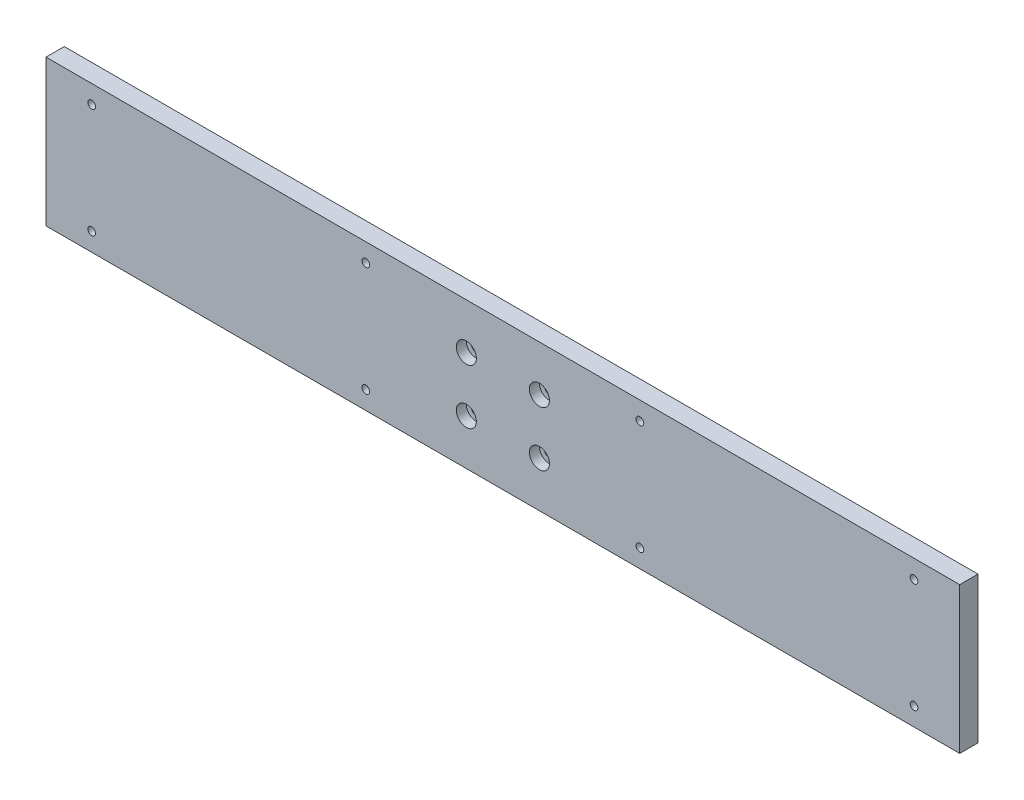
ISO-10303-21;
HEADER;
FILE_DESCRIPTION(('STEP AP214'),'2;1');
FILE_NAME('part.step','',(''),(''),'','','');
FILE_SCHEMA(('AUTOMOTIVE_DESIGN { 1 0 10303 214 1 1 1 1 }'));
ENDSEC;
DATA;
#1=APPLICATION_CONTEXT('core data for automotive mechanical design processes');
#2=APPLICATION_PROTOCOL_DEFINITION('international standard','automotive_design',2000,#1);
#3=PRODUCT_CONTEXT('',#1,'mechanical');
#4=PRODUCT('Part','Part','',(#3));
#5=PRODUCT_RELATED_PRODUCT_CATEGORY('part','',(#4));
#6=PRODUCT_DEFINITION_FORMATION('','',#4);
#7=PRODUCT_DEFINITION_CONTEXT('part definition',#1,'design');
#8=PRODUCT_DEFINITION('design','',#6,#7);
#9=PRODUCT_DEFINITION_SHAPE('','',#8);
#10=(LENGTH_UNIT() NAMED_UNIT(*) SI_UNIT(.MILLI.,.METRE.));
#11=(NAMED_UNIT(*) PLANE_ANGLE_UNIT() SI_UNIT($,.RADIAN.));
#12=(NAMED_UNIT(*) SI_UNIT($,.STERADIAN.) SOLID_ANGLE_UNIT());
#13=UNCERTAINTY_MEASURE_WITH_UNIT(LENGTH_MEASURE(1.E-05),#10,'distance_accuracy_value','');
#14=(GEOMETRIC_REPRESENTATION_CONTEXT(3) GLOBAL_UNCERTAINTY_ASSIGNED_CONTEXT((#13)) GLOBAL_UNIT_ASSIGNED_CONTEXT((#10,
#11,#12)) REPRESENTATION_CONTEXT('',''));
#15=CARTESIAN_POINT('',(0.,0.,0.));
#16=DIRECTION('',(0.,0.,1.));
#17=DIRECTION('',(1.,0.,0.));
#18=AXIS2_PLACEMENT_3D('',#15,#16,#17);
#19=CARTESIAN_POINT('',(-20.,15.,0.));
#20=DIRECTION('',(0.,0.,1.));
#21=DIRECTION('',(1.,0.,0.));
#22=AXIS2_PLACEMENT_3D('',#19,#20,#21);
#23=CYLINDRICAL_SURFACE('',#22,2.75);
#24=CARTESIAN_POINT('',(-20.,15.,0.));
#25=DIRECTION('',(0.,0.,1.));
#26=DIRECTION('',(1.,0.,0.));
#27=AXIS2_PLACEMENT_3D('',#24,#25,#26);
#28=CIRCLE('',#27,2.75);
#29=CARTESIAN_POINT('',(-17.25,15.,0.));
#30=VERTEX_POINT('',#29);
#31=EDGE_CURVE('E123',#30,#30,#28,.T.);
#32=ORIENTED_EDGE('',*,*,#31,.F.);
#33=EDGE_LOOP('',(#32));
#34=FACE_BOUND('',#33,.T.);
#35=CARTESIAN_POINT('',(-20.,15.,4.5));
#36=DIRECTION('',(0.,0.,1.));
#37=DIRECTION('',(1.,0.,0.));
#38=AXIS2_PLACEMENT_3D('',#35,#36,#37);
#39=CIRCLE('',#38,2.75);
#40=CARTESIAN_POINT('',(-17.25,15.,4.5));
#41=VERTEX_POINT('',#40);
#42=EDGE_CURVE('E147',#41,#41,#39,.F.);
#43=ORIENTED_EDGE('',*,*,#42,.F.);
#44=EDGE_LOOP('',(#43));
#45=FACE_BOUND('',#44,.T.);
#46=ADVANCED_FACE('F46',(#34,#45),#23,.F.);
#47=CARTESIAN_POINT('',(20.,15.,0.));
#48=DIRECTION('',(0.,0.,1.));
#49=DIRECTION('',(1.,0.,0.));
#50=AXIS2_PLACEMENT_3D('',#47,#48,#49);
#51=CYLINDRICAL_SURFACE('',#50,2.75);
#52=CARTESIAN_POINT('',(20.,15.,0.));
#53=DIRECTION('',(0.,0.,1.));
#54=DIRECTION('',(1.,0.,0.));
#55=AXIS2_PLACEMENT_3D('',#52,#53,#54);
#56=CIRCLE('',#55,2.75);
#57=CARTESIAN_POINT('',(22.75,15.,0.));
#58=VERTEX_POINT('',#57);
#59=EDGE_CURVE('E210',#58,#58,#56,.T.);
#60=ORIENTED_EDGE('',*,*,#59,.F.);
#61=EDGE_LOOP('',(#60));
#62=FACE_BOUND('',#61,.T.);
#63=CARTESIAN_POINT('',(20.,15.,4.5));
#64=DIRECTION('',(0.,0.,1.));
#65=DIRECTION('',(1.,0.,0.));
#66=AXIS2_PLACEMENT_3D('',#63,#64,#65);
#67=CIRCLE('',#66,2.75);
#68=CARTESIAN_POINT('',(22.75,15.,4.5));
#69=VERTEX_POINT('',#68);
#70=EDGE_CURVE('E143',#69,#69,#67,.F.);
#71=ORIENTED_EDGE('',*,*,#70,.F.);
#72=EDGE_LOOP('',(#71));
#73=FACE_BOUND('',#72,.T.);
#74=ADVANCED_FACE('F255',(#62,#73),#51,.F.);
#75=CARTESIAN_POINT('',(20.,-15.,0.));
#76=DIRECTION('',(0.,0.,1.));
#77=DIRECTION('',(1.,0.,0.));
#78=AXIS2_PLACEMENT_3D('',#75,#76,#77);
#79=CYLINDRICAL_SURFACE('',#78,2.75);
#80=CARTESIAN_POINT('',(20.,-15.,0.));
#81=DIRECTION('',(0.,0.,1.));
#82=DIRECTION('',(1.,0.,0.));
#83=AXIS2_PLACEMENT_3D('',#80,#81,#82);
#84=CIRCLE('',#83,2.75);
#85=CARTESIAN_POINT('',(22.75,-15.,0.));
#86=VERTEX_POINT('',#85);
#87=EDGE_CURVE('E214',#86,#86,#84,.T.);
#88=ORIENTED_EDGE('',*,*,#87,.F.);
#89=EDGE_LOOP('',(#88));
#90=FACE_BOUND('',#89,.T.);
#91=CARTESIAN_POINT('',(20.,-15.,4.5));
#92=DIRECTION('',(0.,0.,1.));
#93=DIRECTION('',(1.,0.,0.));
#94=AXIS2_PLACEMENT_3D('',#91,#92,#93);
#95=CIRCLE('',#94,2.75);
#96=CARTESIAN_POINT('',(22.75,-15.,4.5));
#97=VERTEX_POINT('',#96);
#98=EDGE_CURVE('E138',#97,#97,#95,.F.);
#99=ORIENTED_EDGE('',*,*,#98,.F.);
#100=EDGE_LOOP('',(#99));
#101=FACE_BOUND('',#100,.T.);
#102=ADVANCED_FACE('F285',(#90,#101),#79,.F.);
#103=CARTESIAN_POINT('',(-20.,-15.,0.));
#104=DIRECTION('',(0.,0.,1.));
#105=DIRECTION('',(1.,0.,0.));
#106=AXIS2_PLACEMENT_3D('',#103,#104,#105);
#107=CYLINDRICAL_SURFACE('',#106,2.75);
#108=CARTESIAN_POINT('',(-20.,-15.,0.));
#109=DIRECTION('',(0.,0.,1.));
#110=DIRECTION('',(1.,0.,0.));
#111=AXIS2_PLACEMENT_3D('',#108,#109,#110);
#112=CIRCLE('',#111,2.75);
#113=CARTESIAN_POINT('',(-17.25,-15.,0.));
#114=VERTEX_POINT('',#113);
#115=EDGE_CURVE('E150',#114,#114,#112,.T.);
#116=ORIENTED_EDGE('',*,*,#115,.F.);
#117=EDGE_LOOP('',(#116));
#118=FACE_BOUND('',#117,.T.);
#119=CARTESIAN_POINT('',(-20.,-15.,4.5));
#120=DIRECTION('',(0.,0.,1.));
#121=DIRECTION('',(1.,0.,0.));
#122=AXIS2_PLACEMENT_3D('',#119,#120,#121);
#123=CIRCLE('',#122,2.75);
#124=CARTESIAN_POINT('',(-17.25,-15.,4.5));
#125=VERTEX_POINT('',#124);
#126=EDGE_CURVE('E134',#125,#125,#123,.F.);
#127=ORIENTED_EDGE('',*,*,#126,.F.);
#128=EDGE_LOOP('',(#127));
#129=FACE_BOUND('',#128,.T.);
#130=ADVANCED_FACE('F289',(#118,#129),#107,.F.);
#131=CARTESIAN_POINT('',(250.,-40.,10.));
#132=DIRECTION('',(-1.,0.,0.));
#133=DIRECTION('',(0.,0.,1.));
#134=AXIS2_PLACEMENT_3D('',#131,#132,#133);
#135=PLANE('',#134);
#136=DIRECTION('',(0.,1.,0.));
#137=VECTOR('',#136,1.);
#138=CARTESIAN_POINT('',(250.,-40.,0.));
#139=LINE('',#138,#137);
#140=CARTESIAN_POINT('',(250.,-40.,0.));
#141=VERTEX_POINT('',#140);
#142=CARTESIAN_POINT('',(250.,40.,0.));
#143=VERTEX_POINT('',#142);
#144=EDGE_CURVE('E119',#141,#143,#139,.T.);
#145=ORIENTED_EDGE('',*,*,#144,.T.);
#146=DIRECTION('',(0.,0.,-1.));
#147=VECTOR('',#146,1.);
#148=CARTESIAN_POINT('',(250.,40.,10.));
#149=LINE('',#148,#147);
#150=CARTESIAN_POINT('',(250.,40.,10.));
#151=VERTEX_POINT('',#150);
#152=EDGE_CURVE('E11',#151,#143,#149,.T.);
#153=ORIENTED_EDGE('',*,*,#152,.F.);
#154=DIRECTION('',(0.,1.,0.));
#155=VECTOR('',#154,1.);
#156=CARTESIAN_POINT('',(250.,-40.,10.));
#157=LINE('',#156,#155);
#158=CARTESIAN_POINT('',(250.,-40.,10.));
#159=VERTEX_POINT('',#158);
#160=EDGE_CURVE('E101',#159,#151,#157,.T.);
#161=ORIENTED_EDGE('',*,*,#160,.F.);
#162=DIRECTION('',(0.,0.,-1.));
#163=VECTOR('',#162,1.);
#164=CARTESIAN_POINT('',(250.,-40.,10.));
#165=LINE('',#164,#163);
#166=EDGE_CURVE('E115',#159,#141,#165,.T.);
#167=ORIENTED_EDGE('',*,*,#166,.T.);
#168=EDGE_LOOP('',(#145,#153,#161,#167));
#169=FACE_BOUND('',#168,.T.);
#170=ADVANCED_FACE('F48',(#169),#135,.F.);
#171=CARTESIAN_POINT('',(-250.,40.,10.));
#172=DIRECTION('',(0.,-1.,0.));
#173=DIRECTION('',(0.,0.,-1.));
#174=AXIS2_PLACEMENT_3D('',#171,#172,#173);
#175=PLANE('',#174);
#176=DIRECTION('',(-1.,0.,0.));
#177=VECTOR('',#176,1.);
#178=CARTESIAN_POINT('',(-250.,40.,0.));
#179=LINE('',#178,#177);
#180=CARTESIAN_POINT('',(-250.,40.,0.));
#181=VERTEX_POINT('',#180);
#182=EDGE_CURVE('E106',#143,#181,#179,.T.);
#183=ORIENTED_EDGE('',*,*,#182,.T.);
#184=DIRECTION('',(0.,0.,-1.));
#185=VECTOR('',#184,1.);
#186=CARTESIAN_POINT('',(-250.,40.,10.));
#187=LINE('',#186,#185);
#188=CARTESIAN_POINT('',(-250.,40.,10.));
#189=VERTEX_POINT('',#188);
#190=EDGE_CURVE('E57',#189,#181,#187,.T.);
#191=ORIENTED_EDGE('',*,*,#190,.F.);
#192=DIRECTION('',(-1.,0.,0.));
#193=VECTOR('',#192,1.);
#194=CARTESIAN_POINT('',(-250.,40.,10.));
#195=LINE('',#194,#193);
#196=EDGE_CURVE('E96',#151,#189,#195,.T.);
#197=ORIENTED_EDGE('',*,*,#196,.F.);
#198=ORIENTED_EDGE('',*,*,#152,.T.);
#199=EDGE_LOOP('',(#183,#191,#197,#198));
#200=FACE_BOUND('',#199,.T.);
#201=ADVANCED_FACE('F105',(#200),#175,.F.);
#202=CARTESIAN_POINT('',(-250.,-40.,10.));
#203=DIRECTION('',(1.,0.,0.));
#204=DIRECTION('',(0.,0.,-1.));
#205=AXIS2_PLACEMENT_3D('',#202,#203,#204);
#206=PLANE('',#205);
#207=DIRECTION('',(0.,-1.,0.));
#208=VECTOR('',#207,1.);
#209=CARTESIAN_POINT('',(-250.,-40.,0.));
#210=LINE('',#209,#208);
#211=CARTESIAN_POINT('',(-250.,-40.,0.));
#212=VERTEX_POINT('',#211);
#213=EDGE_CURVE('E83',#181,#212,#210,.T.);
#214=ORIENTED_EDGE('',*,*,#213,.T.);
#215=DIRECTION('',(0.,0.,-1.));
#216=VECTOR('',#215,1.);
#217=CARTESIAN_POINT('',(-250.,-40.,10.));
#218=LINE('',#217,#216);
#219=CARTESIAN_POINT('',(-250.,-40.,10.));
#220=VERTEX_POINT('',#219);
#221=EDGE_CURVE('E108',#220,#212,#218,.T.);
#222=ORIENTED_EDGE('',*,*,#221,.F.);
#223=DIRECTION('',(0.,-1.,0.));
#224=VECTOR('',#223,1.);
#225=CARTESIAN_POINT('',(-250.,-40.,10.));
#226=LINE('',#225,#224);
#227=EDGE_CURVE('E99',#189,#220,#226,.T.);
#228=ORIENTED_EDGE('',*,*,#227,.F.);
#229=ORIENTED_EDGE('',*,*,#190,.T.);
#230=EDGE_LOOP('',(#214,#222,#228,#229));
#231=FACE_BOUND('',#230,.T.);
#232=ADVANCED_FACE('F110',(#231),#206,.F.);
#233=CARTESIAN_POINT('',(-250.,-40.,10.));
#234=DIRECTION('',(0.,1.,0.));
#235=DIRECTION('',(0.,0.,1.));
#236=AXIS2_PLACEMENT_3D('',#233,#234,#235);
#237=PLANE('',#236);
#238=DIRECTION('',(1.,0.,0.));
#239=VECTOR('',#238,1.);
#240=CARTESIAN_POINT('',(-250.,-40.,0.));
#241=LINE('',#240,#239);
#242=EDGE_CURVE('E89',#212,#141,#241,.T.);
#243=ORIENTED_EDGE('',*,*,#242,.T.);
#244=ORIENTED_EDGE('',*,*,#166,.F.);
#245=DIRECTION('',(1.,0.,0.));
#246=VECTOR('',#245,1.);
#247=CARTESIAN_POINT('',(-250.,-40.,10.));
#248=LINE('',#247,#246);
#249=EDGE_CURVE('E66',#220,#159,#248,.T.);
#250=ORIENTED_EDGE('',*,*,#249,.F.);
#251=ORIENTED_EDGE('',*,*,#221,.T.);
#252=EDGE_LOOP('',(#243,#244,#250,#251));
#253=FACE_BOUND('',#252,.T.);
#254=ADVANCED_FACE('F296',(#253),#237,.F.);
#255=CARTESIAN_POINT('',(0.,0.,10.));
#256=DIRECTION('',(0.,0.,-1.));
#257=DIRECTION('',(-1.,0.,0.));
#258=AXIS2_PLACEMENT_3D('',#255,#256,#257);
#259=PLANE('',#258);
#260=CARTESIAN_POINT('',(-225.,30.,10.));
#261=DIRECTION('',(0.,0.,1.));
#262=DIRECTION('',(1.,0.,0.));
#263=AXIS2_PLACEMENT_3D('',#260,#261,#262);
#264=CIRCLE('',#263,2.09999999999999);
#265=CARTESIAN_POINT('',(-222.9,30.,10.));
#266=VERTEX_POINT('',#265);
#267=EDGE_CURVE('E625',#266,#266,#264,.T.);
#268=ORIENTED_EDGE('',*,*,#267,.F.);
#269=EDGE_LOOP('',(#268));
#270=FACE_BOUND('',#269,.T.);
#271=CARTESIAN_POINT('',(-225.,-30.,10.));
#272=DIRECTION('',(0.,0.,1.));
#273=DIRECTION('',(1.,0.,0.));
#274=AXIS2_PLACEMENT_3D('',#271,#272,#273);
#275=CIRCLE('',#274,2.09999999999999);
#276=CARTESIAN_POINT('',(-222.9,-30.,10.));
#277=VERTEX_POINT('',#276);
#278=EDGE_CURVE('E630',#277,#277,#275,.T.);
#279=ORIENTED_EDGE('',*,*,#278,.F.);
#280=EDGE_LOOP('',(#279));
#281=FACE_BOUND('',#280,.T.);
#282=CARTESIAN_POINT('',(-75.,-30.,10.));
#283=DIRECTION('',(0.,0.,1.));
#284=DIRECTION('',(1.,0.,0.));
#285=AXIS2_PLACEMENT_3D('',#282,#283,#284);
#286=CIRCLE('',#285,2.09999999999999);
#287=CARTESIAN_POINT('',(-72.9,-30.,10.));
#288=VERTEX_POINT('',#287);
#289=EDGE_CURVE('E639',#288,#288,#286,.T.);
#290=ORIENTED_EDGE('',*,*,#289,.F.);
#291=EDGE_LOOP('',(#290));
#292=FACE_BOUND('',#291,.T.);
#293=CARTESIAN_POINT('',(-75.,30.,10.));
#294=DIRECTION('',(0.,0.,1.));
#295=DIRECTION('',(1.,0.,0.));
#296=AXIS2_PLACEMENT_3D('',#293,#294,#295);
#297=CIRCLE('',#296,2.09999999999999);
#298=CARTESIAN_POINT('',(-72.9,30.,10.));
#299=VERTEX_POINT('',#298);
#300=EDGE_CURVE('E647',#299,#299,#297,.T.);
#301=ORIENTED_EDGE('',*,*,#300,.F.);
#302=EDGE_LOOP('',(#301));
#303=FACE_BOUND('',#302,.T.);
#304=CARTESIAN_POINT('',(75.,30.,10.));
#305=DIRECTION('',(0.,0.,1.));
#306=DIRECTION('',(1.,0.,0.));
#307=AXIS2_PLACEMENT_3D('',#304,#305,#306);
#308=CIRCLE('',#307,2.09999999999999);
#309=CARTESIAN_POINT('',(77.1,30.,10.));
#310=VERTEX_POINT('',#309);
#311=EDGE_CURVE('E655',#310,#310,#308,.T.);
#312=ORIENTED_EDGE('',*,*,#311,.F.);
#313=EDGE_LOOP('',(#312));
#314=FACE_BOUND('',#313,.T.);
#315=CARTESIAN_POINT('',(75.,-30.,10.));
#316=DIRECTION('',(0.,0.,1.));
#317=DIRECTION('',(1.,0.,0.));
#318=AXIS2_PLACEMENT_3D('',#315,#316,#317);
#319=CIRCLE('',#318,2.09999999999999);
#320=CARTESIAN_POINT('',(77.1,-30.,10.));
#321=VERTEX_POINT('',#320);
#322=EDGE_CURVE('E172',#321,#321,#319,.T.);
#323=ORIENTED_EDGE('',*,*,#322,.F.);
#324=EDGE_LOOP('',(#323));
#325=FACE_BOUND('',#324,.T.);
#326=CARTESIAN_POINT('',(225.,-30.,10.));
#327=DIRECTION('',(0.,0.,1.));
#328=DIRECTION('',(1.,0.,0.));
#329=AXIS2_PLACEMENT_3D('',#326,#327,#328);
#330=CIRCLE('',#329,2.09999999999999);
#331=CARTESIAN_POINT('',(227.1,-30.,10.));
#332=VERTEX_POINT('',#331);
#333=EDGE_CURVE('E155',#332,#332,#330,.T.);
#334=ORIENTED_EDGE('',*,*,#333,.F.);
#335=EDGE_LOOP('',(#334));
#336=FACE_BOUND('',#335,.T.);
#337=CARTESIAN_POINT('',(225.,30.,10.));
#338=DIRECTION('',(0.,0.,1.));
#339=DIRECTION('',(1.,0.,0.));
#340=AXIS2_PLACEMENT_3D('',#337,#338,#339);
#341=CIRCLE('',#340,2.09999999999999);
#342=CARTESIAN_POINT('',(227.1,30.,10.));
#343=VERTEX_POINT('',#342);
#344=EDGE_CURVE('E154',#343,#343,#341,.T.);
#345=ORIENTED_EDGE('',*,*,#344,.F.);
#346=EDGE_LOOP('',(#345));
#347=FACE_BOUND('',#346,.T.);
#348=CARTESIAN_POINT('',(-20.,15.,10.));
#349=DIRECTION('',(0.,0.,1.));
#350=DIRECTION('',(1.,0.,0.));
#351=AXIS2_PLACEMENT_3D('',#348,#349,#350);
#352=CIRCLE('',#351,5.5);
#353=CARTESIAN_POINT('',(-14.5,15.,10.));
#354=VERTEX_POINT('',#353);
#355=EDGE_CURVE('E179',#354,#354,#352,.T.);
#356=ORIENTED_EDGE('',*,*,#355,.F.);
#357=EDGE_LOOP('',(#356));
#358=FACE_BOUND('',#357,.T.);
#359=CARTESIAN_POINT('',(-20.,-15.,10.));
#360=DIRECTION('',(0.,0.,1.));
#361=DIRECTION('',(1.,0.,0.));
#362=AXIS2_PLACEMENT_3D('',#359,#360,#361);
#363=CIRCLE('',#362,5.5);
#364=CARTESIAN_POINT('',(-14.5,-15.,10.));
#365=VERTEX_POINT('',#364);
#366=EDGE_CURVE('E193',#365,#365,#363,.T.);
#367=ORIENTED_EDGE('',*,*,#366,.F.);
#368=EDGE_LOOP('',(#367));
#369=FACE_BOUND('',#368,.T.);
#370=CARTESIAN_POINT('',(20.,-15.,10.));
#371=DIRECTION('',(0.,0.,1.));
#372=DIRECTION('',(1.,0.,0.));
#373=AXIS2_PLACEMENT_3D('',#370,#371,#372);
#374=CIRCLE('',#373,5.5);
#375=CARTESIAN_POINT('',(25.5,-15.,10.));
#376=VERTEX_POINT('',#375);
#377=EDGE_CURVE('E185',#376,#376,#374,.T.);
#378=ORIENTED_EDGE('',*,*,#377,.F.);
#379=EDGE_LOOP('',(#378));
#380=FACE_BOUND('',#379,.T.);
#381=CARTESIAN_POINT('',(20.,15.,10.));
#382=DIRECTION('',(0.,0.,1.));
#383=DIRECTION('',(1.,0.,0.));
#384=AXIS2_PLACEMENT_3D('',#381,#382,#383);
#385=CIRCLE('',#384,5.5);
#386=CARTESIAN_POINT('',(25.5,15.,10.));
#387=VERTEX_POINT('',#386);
#388=EDGE_CURVE('E184',#387,#387,#385,.T.);
#389=ORIENTED_EDGE('',*,*,#388,.F.);
#390=EDGE_LOOP('',(#389));
#391=FACE_BOUND('',#390,.T.);
#392=ORIENTED_EDGE('',*,*,#160,.T.);
#393=ORIENTED_EDGE('',*,*,#196,.T.);
#394=ORIENTED_EDGE('',*,*,#227,.T.);
#395=ORIENTED_EDGE('',*,*,#249,.T.);
#396=EDGE_LOOP('',(#392,#393,#394,#395));
#397=FACE_BOUND('',#396,.T.);
#398=ADVANCED_FACE('F97',(#270,#281,#292,#303,#314,#325,#336,#347,#358,#369,#380,#391,#397),
#259,.F.);
#399=CARTESIAN_POINT('',(0.,0.,0.));
#400=DIRECTION('',(0.,0.,-1.));
#401=DIRECTION('',(-1.,0.,0.));
#402=AXIS2_PLACEMENT_3D('',#399,#400,#401);
#403=PLANE('',#402);
#404=CARTESIAN_POINT('',(-225.,30.,0.));
#405=DIRECTION('',(0.,0.,-1.));
#406=DIRECTION('',(-1.,0.,0.));
#407=AXIS2_PLACEMENT_3D('',#404,#405,#406);
#408=CIRCLE('',#407,2.09999999999999);
#409=CARTESIAN_POINT('',(-227.1,30.,0.));
#410=VERTEX_POINT('',#409);
#411=EDGE_CURVE('E50',#410,#410,#408,.T.);
#412=ORIENTED_EDGE('',*,*,#411,.F.);
#413=EDGE_LOOP('',(#412));
#414=FACE_BOUND('',#413,.T.);
#415=CARTESIAN_POINT('',(-225.,-30.,0.));
#416=DIRECTION('',(0.,0.,-1.));
#417=DIRECTION('',(-1.,0.,0.));
#418=AXIS2_PLACEMENT_3D('',#415,#416,#417);
#419=CIRCLE('',#418,2.09999999999999);
#420=CARTESIAN_POINT('',(-227.1,-30.,0.));
#421=VERTEX_POINT('',#420);
#422=EDGE_CURVE('E635',#421,#421,#419,.T.);
#423=ORIENTED_EDGE('',*,*,#422,.F.);
#424=EDGE_LOOP('',(#423));
#425=FACE_BOUND('',#424,.T.);
#426=CARTESIAN_POINT('',(-75.,-30.,0.));
#427=DIRECTION('',(0.,0.,-1.));
#428=DIRECTION('',(-1.,0.,0.));
#429=AXIS2_PLACEMENT_3D('',#426,#427,#428);
#430=CIRCLE('',#429,2.09999999999999);
#431=CARTESIAN_POINT('',(-77.1,-30.,0.));
#432=VERTEX_POINT('',#431);
#433=EDGE_CURVE('E643',#432,#432,#430,.T.);
#434=ORIENTED_EDGE('',*,*,#433,.F.);
#435=EDGE_LOOP('',(#434));
#436=FACE_BOUND('',#435,.T.);
#437=CARTESIAN_POINT('',(-75.,30.,0.));
#438=DIRECTION('',(0.,0.,-1.));
#439=DIRECTION('',(-1.,0.,0.));
#440=AXIS2_PLACEMENT_3D('',#437,#438,#439);
#441=CIRCLE('',#440,2.09999999999999);
#442=CARTESIAN_POINT('',(-77.1,30.,0.));
#443=VERTEX_POINT('',#442);
#444=EDGE_CURVE('E651',#443,#443,#441,.T.);
#445=ORIENTED_EDGE('',*,*,#444,.F.);
#446=EDGE_LOOP('',(#445));
#447=FACE_BOUND('',#446,.T.);
#448=CARTESIAN_POINT('',(75.,30.,0.));
#449=DIRECTION('',(0.,0.,-1.));
#450=DIRECTION('',(-1.,0.,0.));
#451=AXIS2_PLACEMENT_3D('',#448,#449,#450);
#452=CIRCLE('',#451,2.09999999999999);
#453=CARTESIAN_POINT('',(72.9,30.,0.));
#454=VERTEX_POINT('',#453);
#455=EDGE_CURVE('E659',#454,#454,#452,.T.);
#456=ORIENTED_EDGE('',*,*,#455,.F.);
#457=EDGE_LOOP('',(#456));
#458=FACE_BOUND('',#457,.T.);
#459=CARTESIAN_POINT('',(75.,-30.,0.));
#460=DIRECTION('',(0.,0.,-1.));
#461=DIRECTION('',(-1.,0.,0.));
#462=AXIS2_PLACEMENT_3D('',#459,#460,#461);
#463=CIRCLE('',#462,2.09999999999999);
#464=CARTESIAN_POINT('',(72.9,-30.,0.));
#465=VERTEX_POINT('',#464);
#466=EDGE_CURVE('E165',#465,#465,#463,.T.);
#467=ORIENTED_EDGE('',*,*,#466,.F.);
#468=EDGE_LOOP('',(#467));
#469=FACE_BOUND('',#468,.T.);
#470=CARTESIAN_POINT('',(225.,-30.,0.));
#471=DIRECTION('',(0.,0.,-1.));
#472=DIRECTION('',(-1.,0.,0.));
#473=AXIS2_PLACEMENT_3D('',#470,#471,#472);
#474=CIRCLE('',#473,2.09999999999999);
#475=CARTESIAN_POINT('',(222.9,-30.,0.));
#476=VERTEX_POINT('',#475);
#477=EDGE_CURVE('E151',#476,#476,#474,.T.);
#478=ORIENTED_EDGE('',*,*,#477,.F.);
#479=EDGE_LOOP('',(#478));
#480=FACE_BOUND('',#479,.T.);
#481=CARTESIAN_POINT('',(225.,30.,0.));
#482=DIRECTION('',(0.,0.,-1.));
#483=DIRECTION('',(-1.,0.,0.));
#484=AXIS2_PLACEMENT_3D('',#481,#482,#483);
#485=CIRCLE('',#484,2.09999999999999);
#486=CARTESIAN_POINT('',(222.9,30.,0.));
#487=VERTEX_POINT('',#486);
#488=EDGE_CURVE('E162',#487,#487,#485,.T.);
#489=ORIENTED_EDGE('',*,*,#488,.F.);
#490=EDGE_LOOP('',(#489));
#491=FACE_BOUND('',#490,.T.);
#492=ORIENTED_EDGE('',*,*,#115,.T.);
#493=EDGE_LOOP('',(#492));
#494=FACE_BOUND('',#493,.T.);
#495=ORIENTED_EDGE('',*,*,#87,.T.);
#496=EDGE_LOOP('',(#495));
#497=FACE_BOUND('',#496,.T.);
#498=ORIENTED_EDGE('',*,*,#59,.T.);
#499=EDGE_LOOP('',(#498));
#500=FACE_BOUND('',#499,.T.);
#501=ORIENTED_EDGE('',*,*,#31,.T.);
#502=EDGE_LOOP('',(#501));
#503=FACE_BOUND('',#502,.T.);
#504=ORIENTED_EDGE('',*,*,#144,.F.);
#505=ORIENTED_EDGE('',*,*,#242,.F.);
#506=ORIENTED_EDGE('',*,*,#213,.F.);
#507=ORIENTED_EDGE('',*,*,#182,.F.);
#508=EDGE_LOOP('',(#504,#505,#506,#507));
#509=FACE_BOUND('',#508,.T.);
#510=ADVANCED_FACE('F250',(#414,#425,#436,#447,#458,#469,#480,#491,#494,#497,#500,#503,#509),
#403,.T.);
#511=CARTESIAN_POINT('',(-20.,-15.,4.5));
#512=DIRECTION('',(0.,0.,1.));
#513=DIRECTION('',(1.,0.,0.));
#514=AXIS2_PLACEMENT_3D('',#511,#512,#513);
#515=PLANE('',#514);
#516=CARTESIAN_POINT('',(-20.,-15.,4.5));
#517=DIRECTION('',(0.,0.,1.));
#518=DIRECTION('',(1.,0.,0.));
#519=AXIS2_PLACEMENT_3D('',#516,#517,#518);
#520=CIRCLE('',#519,5.5);
#521=CARTESIAN_POINT('',(-14.5,-15.,4.5));
#522=VERTEX_POINT('',#521);
#523=EDGE_CURVE('E189',#522,#522,#520,.T.);
#524=ORIENTED_EDGE('',*,*,#523,.T.);
#525=EDGE_LOOP('',(#524));
#526=FACE_BOUND('',#525,.T.);
#527=ORIENTED_EDGE('',*,*,#126,.T.);
#528=EDGE_LOOP('',(#527));
#529=FACE_BOUND('',#528,.T.);
#530=ADVANCED_FACE('F300',(#526,#529),#515,.T.);
#531=CARTESIAN_POINT('',(-20.,-15.,4.5));
#532=DIRECTION('',(0.,0.,1.));
#533=DIRECTION('',(1.,0.,0.));
#534=AXIS2_PLACEMENT_3D('',#531,#532,#533);
#535=CYLINDRICAL_SURFACE('',#534,5.5);
#536=ORIENTED_EDGE('',*,*,#523,.F.);
#537=EDGE_LOOP('',(#536));
#538=FACE_BOUND('',#537,.T.);
#539=ORIENTED_EDGE('',*,*,#366,.T.);
#540=EDGE_LOOP('',(#539));
#541=FACE_BOUND('',#540,.T.);
#542=ADVANCED_FACE('F276',(#538,#541),#535,.F.);
#543=CARTESIAN_POINT('',(20.,-15.,4.5));
#544=DIRECTION('',(0.,0.,1.));
#545=DIRECTION('',(1.,0.,0.));
#546=AXIS2_PLACEMENT_3D('',#543,#544,#545);
#547=PLANE('',#546);
#548=CARTESIAN_POINT('',(20.,-15.,4.5));
#549=DIRECTION('',(0.,0.,1.));
#550=DIRECTION('',(1.,0.,0.));
#551=AXIS2_PLACEMENT_3D('',#548,#549,#550);
#552=CIRCLE('',#551,5.5);
#553=CARTESIAN_POINT('',(25.5,-15.,4.5));
#554=VERTEX_POINT('',#553);
#555=EDGE_CURVE('E180',#554,#554,#552,.T.);
#556=ORIENTED_EDGE('',*,*,#555,.T.);
#557=EDGE_LOOP('',(#556));
#558=FACE_BOUND('',#557,.T.);
#559=ORIENTED_EDGE('',*,*,#98,.T.);
#560=EDGE_LOOP('',(#559));
#561=FACE_BOUND('',#560,.T.);
#562=ADVANCED_FACE('F369',(#558,#561),#547,.T.);
#563=CARTESIAN_POINT('',(20.,-15.,4.5));
#564=DIRECTION('',(0.,0.,1.));
#565=DIRECTION('',(1.,0.,0.));
#566=AXIS2_PLACEMENT_3D('',#563,#564,#565);
#567=CYLINDRICAL_SURFACE('',#566,5.5);
#568=ORIENTED_EDGE('',*,*,#555,.F.);
#569=EDGE_LOOP('',(#568));
#570=FACE_BOUND('',#569,.T.);
#571=ORIENTED_EDGE('',*,*,#377,.T.);
#572=EDGE_LOOP('',(#571));
#573=FACE_BOUND('',#572,.T.);
#574=ADVANCED_FACE('F280',(#570,#573),#567,.F.);
#575=CARTESIAN_POINT('',(20.,15.,4.5));
#576=DIRECTION('',(0.,0.,1.));
#577=DIRECTION('',(1.,0.,0.));
#578=AXIS2_PLACEMENT_3D('',#575,#576,#577);
#579=PLANE('',#578);
#580=CARTESIAN_POINT('',(20.,15.,4.5));
#581=DIRECTION('',(0.,0.,1.));
#582=DIRECTION('',(1.,0.,0.));
#583=AXIS2_PLACEMENT_3D('',#580,#581,#582);
#584=CIRCLE('',#583,5.5);
#585=CARTESIAN_POINT('',(25.5,15.,4.5));
#586=VERTEX_POINT('',#585);
#587=EDGE_CURVE('E139',#586,#586,#584,.T.);
#588=ORIENTED_EDGE('',*,*,#587,.T.);
#589=EDGE_LOOP('',(#588));
#590=FACE_BOUND('',#589,.T.);
#591=ORIENTED_EDGE('',*,*,#70,.T.);
#592=EDGE_LOOP('',(#591));
#593=FACE_BOUND('',#592,.T.);
#594=ADVANCED_FACE('F272',(#590,#593),#579,.T.);
#595=CARTESIAN_POINT('',(20.,15.,4.5));
#596=DIRECTION('',(0.,0.,1.));
#597=DIRECTION('',(1.,0.,0.));
#598=AXIS2_PLACEMENT_3D('',#595,#596,#597);
#599=CYLINDRICAL_SURFACE('',#598,5.5);
#600=ORIENTED_EDGE('',*,*,#587,.F.);
#601=EDGE_LOOP('',(#600));
#602=FACE_BOUND('',#601,.T.);
#603=ORIENTED_EDGE('',*,*,#388,.T.);
#604=EDGE_LOOP('',(#603));
#605=FACE_BOUND('',#604,.T.);
#606=ADVANCED_FACE('F262',(#602,#605),#599,.F.);
#607=CARTESIAN_POINT('',(-20.,15.,4.5));
#608=DIRECTION('',(0.,0.,1.));
#609=DIRECTION('',(1.,0.,0.));
#610=AXIS2_PLACEMENT_3D('',#607,#608,#609);
#611=PLANE('',#610);
#612=CARTESIAN_POINT('',(-20.,15.,4.5));
#613=DIRECTION('',(0.,0.,1.));
#614=DIRECTION('',(1.,0.,0.));
#615=AXIS2_PLACEMENT_3D('',#612,#613,#614);
#616=CIRCLE('',#615,5.5);
#617=CARTESIAN_POINT('',(-14.5,15.,4.5));
#618=VERTEX_POINT('',#617);
#619=EDGE_CURVE('E197',#618,#618,#616,.T.);
#620=ORIENTED_EDGE('',*,*,#619,.T.);
#621=EDGE_LOOP('',(#620));
#622=FACE_BOUND('',#621,.T.);
#623=ORIENTED_EDGE('',*,*,#42,.T.);
#624=EDGE_LOOP('',(#623));
#625=FACE_BOUND('',#624,.T.);
#626=ADVANCED_FACE('F259',(#622,#625),#611,.T.);
#627=CARTESIAN_POINT('',(-20.,15.,4.5));
#628=DIRECTION('',(0.,0.,1.));
#629=DIRECTION('',(1.,0.,0.));
#630=AXIS2_PLACEMENT_3D('',#627,#628,#629);
#631=CYLINDRICAL_SURFACE('',#630,5.5);
#632=ORIENTED_EDGE('',*,*,#619,.F.);
#633=EDGE_LOOP('',(#632));
#634=FACE_BOUND('',#633,.T.);
#635=ORIENTED_EDGE('',*,*,#355,.T.);
#636=EDGE_LOOP('',(#635));
#637=FACE_BOUND('',#636,.T.);
#638=ADVANCED_FACE('F261',(#634,#637),#631,.F.);
#639=CARTESIAN_POINT('',(225.,30.,10.));
#640=DIRECTION('',(0.,0.,1.));
#641=DIRECTION('',(1.,0.,0.));
#642=AXIS2_PLACEMENT_3D('',#639,#640,#641);
#643=CYLINDRICAL_SURFACE('',#642,2.09999999999999);
#644=ORIENTED_EDGE('',*,*,#488,.T.);
#645=EDGE_LOOP('',(#644));
#646=FACE_BOUND('',#645,.T.);
#647=ORIENTED_EDGE('',*,*,#344,.T.);
#648=EDGE_LOOP('',(#647));
#649=FACE_BOUND('',#648,.T.);
#650=ADVANCED_FACE('F269',(#646,#649),#643,.F.);
#651=CARTESIAN_POINT('',(225.,-30.,10.));
#652=DIRECTION('',(0.,0.,1.));
#653=DIRECTION('',(1.,0.,0.));
#654=AXIS2_PLACEMENT_3D('',#651,#652,#653);
#655=CYLINDRICAL_SURFACE('',#654,2.09999999999999);
#656=ORIENTED_EDGE('',*,*,#477,.T.);
#657=EDGE_LOOP('',(#656));
#658=FACE_BOUND('',#657,.T.);
#659=ORIENTED_EDGE('',*,*,#333,.T.);
#660=EDGE_LOOP('',(#659));
#661=FACE_BOUND('',#660,.T.);
#662=ADVANCED_FACE('F442',(#658,#661),#655,.F.);
#663=CARTESIAN_POINT('',(75.,-30.,10.));
#664=DIRECTION('',(0.,0.,1.));
#665=DIRECTION('',(1.,0.,0.));
#666=AXIS2_PLACEMENT_3D('',#663,#664,#665);
#667=CYLINDRICAL_SURFACE('',#666,2.09999999999999);
#668=ORIENTED_EDGE('',*,*,#466,.T.);
#669=EDGE_LOOP('',(#668));
#670=FACE_BOUND('',#669,.T.);
#671=ORIENTED_EDGE('',*,*,#322,.T.);
#672=EDGE_LOOP('',(#671));
#673=FACE_BOUND('',#672,.T.);
#674=ADVANCED_FACE('F453',(#670,#673),#667,.F.);
#675=CARTESIAN_POINT('',(75.,30.,10.));
#676=DIRECTION('',(0.,0.,1.));
#677=DIRECTION('',(1.,0.,0.));
#678=AXIS2_PLACEMENT_3D('',#675,#676,#677);
#679=CYLINDRICAL_SURFACE('',#678,2.09999999999999);
#680=ORIENTED_EDGE('',*,*,#455,.T.);
#681=EDGE_LOOP('',(#680));
#682=FACE_BOUND('',#681,.T.);
#683=ORIENTED_EDGE('',*,*,#311,.T.);
#684=EDGE_LOOP('',(#683));
#685=FACE_BOUND('',#684,.T.);
#686=ADVANCED_FACE('F464',(#682,#685),#679,.F.);
#687=CARTESIAN_POINT('',(-75.,30.,10.));
#688=DIRECTION('',(0.,0.,1.));
#689=DIRECTION('',(1.,0.,0.));
#690=AXIS2_PLACEMENT_3D('',#687,#688,#689);
#691=CYLINDRICAL_SURFACE('',#690,2.09999999999999);
#692=ORIENTED_EDGE('',*,*,#444,.T.);
#693=EDGE_LOOP('',(#692));
#694=FACE_BOUND('',#693,.T.);
#695=ORIENTED_EDGE('',*,*,#300,.T.);
#696=EDGE_LOOP('',(#695));
#697=FACE_BOUND('',#696,.T.);
#698=ADVANCED_FACE('F476',(#694,#697),#691,.F.);
#699=CARTESIAN_POINT('',(-75.,-30.,10.));
#700=DIRECTION('',(0.,0.,1.));
#701=DIRECTION('',(1.,0.,0.));
#702=AXIS2_PLACEMENT_3D('',#699,#700,#701);
#703=CYLINDRICAL_SURFACE('',#702,2.09999999999999);
#704=ORIENTED_EDGE('',*,*,#433,.T.);
#705=EDGE_LOOP('',(#704));
#706=FACE_BOUND('',#705,.T.);
#707=ORIENTED_EDGE('',*,*,#289,.T.);
#708=EDGE_LOOP('',(#707));
#709=FACE_BOUND('',#708,.T.);
#710=ADVANCED_FACE('F488',(#706,#709),#703,.F.);
#711=CARTESIAN_POINT('',(-225.,-30.,10.));
#712=DIRECTION('',(0.,0.,1.));
#713=DIRECTION('',(1.,0.,0.));
#714=AXIS2_PLACEMENT_3D('',#711,#712,#713);
#715=CYLINDRICAL_SURFACE('',#714,2.09999999999999);
#716=ORIENTED_EDGE('',*,*,#422,.T.);
#717=EDGE_LOOP('',(#716));
#718=FACE_BOUND('',#717,.T.);
#719=ORIENTED_EDGE('',*,*,#278,.T.);
#720=EDGE_LOOP('',(#719));
#721=FACE_BOUND('',#720,.T.);
#722=ADVANCED_FACE('F500',(#718,#721),#715,.F.);
#723=CARTESIAN_POINT('',(-225.,30.,10.));
#724=DIRECTION('',(0.,0.,1.));
#725=DIRECTION('',(1.,0.,0.));
#726=AXIS2_PLACEMENT_3D('',#723,#724,#725);
#727=CYLINDRICAL_SURFACE('',#726,2.09999999999999);
#728=ORIENTED_EDGE('',*,*,#411,.T.);
#729=EDGE_LOOP('',(#728));
#730=FACE_BOUND('',#729,.T.);
#731=ORIENTED_EDGE('',*,*,#267,.T.);
#732=EDGE_LOOP('',(#731));
#733=FACE_BOUND('',#732,.T.);
#734=ADVANCED_FACE('F512',(#730,#733),#727,.F.);
#735=CLOSED_SHELL('',(#46,#74,#102,#130,#170,#201,#232,#254,#398,#510,#530,#542,#562,#574,#594,
#606,#626,#638,#650,#662,#674,#686,#698,#710,#722,#734));
#736=MANIFOLD_SOLID_BREP('B2',#735);
#737=ADVANCED_BREP_SHAPE_REPRESENTATION('',(#18,#736),#14);
#738=SHAPE_DEFINITION_REPRESENTATION(#9,#737);
ENDSEC;
END-ISO-10303-21;
